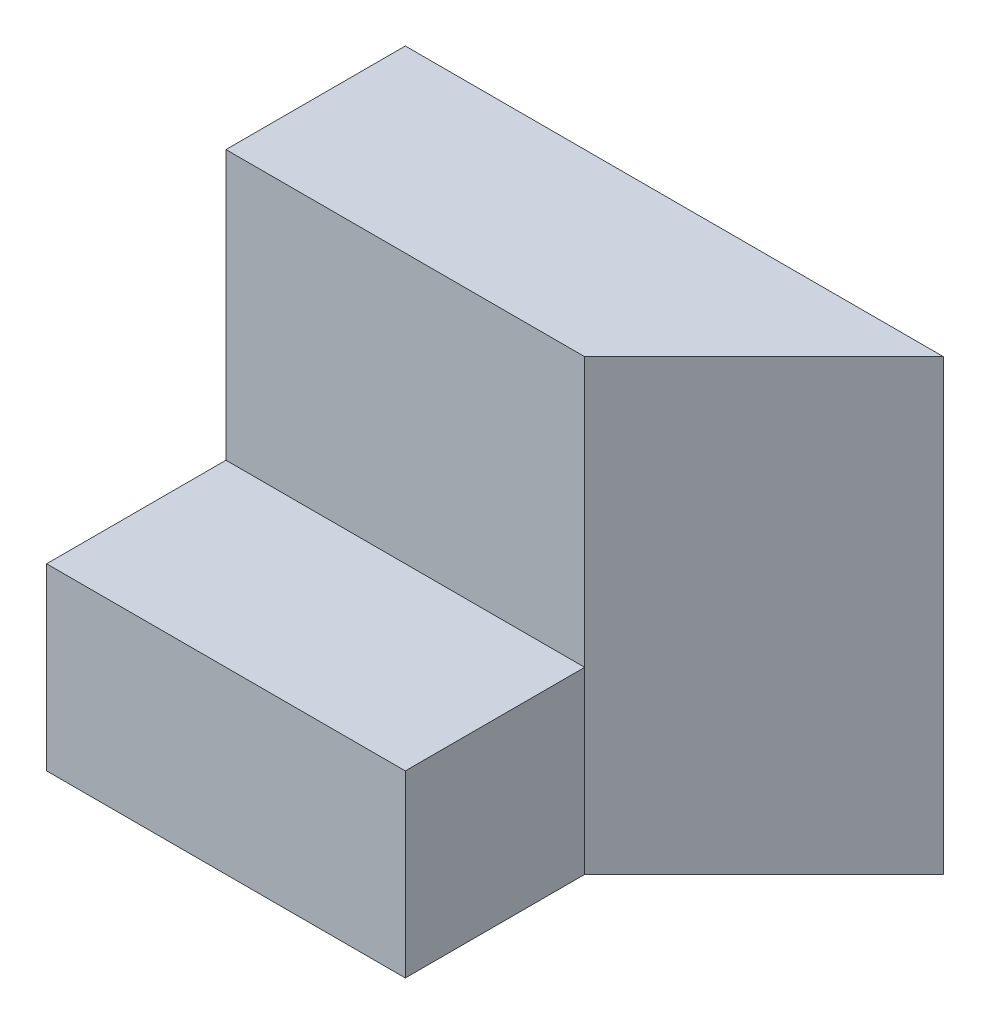
ISO-10303-21;
HEADER;
FILE_DESCRIPTION(('STEP AP214'),'2;1');
FILE_NAME('part.step','',(''),(''),'','','');
FILE_SCHEMA(('AUTOMOTIVE_DESIGN { 1 0 10303 214 1 1 1 1 }'));
ENDSEC;
DATA;
#1=APPLICATION_CONTEXT('core data for automotive mechanical design processes');
#2=APPLICATION_PROTOCOL_DEFINITION('international standard','automotive_design',2000,#1);
#3=PRODUCT_CONTEXT('',#1,'mechanical');
#4=PRODUCT('Part','Part','',(#3));
#5=PRODUCT_RELATED_PRODUCT_CATEGORY('part','',(#4));
#6=PRODUCT_DEFINITION_FORMATION('','',#4);
#7=PRODUCT_DEFINITION_CONTEXT('part definition',#1,'design');
#8=PRODUCT_DEFINITION('design','',#6,#7);
#9=PRODUCT_DEFINITION_SHAPE('','',#8);
#10=(LENGTH_UNIT() NAMED_UNIT(*) SI_UNIT(.MILLI.,.METRE.));
#11=(NAMED_UNIT(*) PLANE_ANGLE_UNIT() SI_UNIT($,.RADIAN.));
#12=(NAMED_UNIT(*) SI_UNIT($,.STERADIAN.) SOLID_ANGLE_UNIT());
#13=UNCERTAINTY_MEASURE_WITH_UNIT(LENGTH_MEASURE(1.E-05),#10,'distance_accuracy_value','');
#14=(GEOMETRIC_REPRESENTATION_CONTEXT(3) GLOBAL_UNCERTAINTY_ASSIGNED_CONTEXT((#13)) GLOBAL_UNIT_ASSIGNED_CONTEXT((#10,
#11,#12)) REPRESENTATION_CONTEXT('',''));
#15=CARTESIAN_POINT('',(0.,0.,0.));
#16=DIRECTION('',(0.,0.,1.));
#17=DIRECTION('',(1.,0.,0.));
#18=AXIS2_PLACEMENT_3D('',#15,#16,#17);
#19=CARTESIAN_POINT('',(0.,5.,0.));
#20=DIRECTION('',(0.,0.,-1.));
#21=DIRECTION('',(-1.,0.,0.));
#22=AXIS2_PLACEMENT_3D('',#19,#20,#21);
#23=PLANE('',#22);
#24=DIRECTION('',(0.,-1.,0.));
#25=VECTOR('',#24,1.);
#26=CARTESIAN_POINT('',(4.,5.,0.));
#27=LINE('',#26,#25);
#28=CARTESIAN_POINT('',(4.,2.,0.));
#29=VERTEX_POINT('',#28);
#30=CARTESIAN_POINT('',(4.,0.,0.));
#31=VERTEX_POINT('',#30);
#32=EDGE_CURVE('E134',#29,#31,#27,.T.);
#33=ORIENTED_EDGE('',*,*,#32,.F.);
#34=DIRECTION('',(-1.,0.,0.));
#35=VECTOR('',#34,1.);
#36=CARTESIAN_POINT('',(15.,2.,0.));
#37=LINE('',#36,#35);
#38=CARTESIAN_POINT('',(0.,2.,0.));
#39=VERTEX_POINT('',#38);
#40=EDGE_CURVE('E140',#29,#39,#37,.T.);
#41=ORIENTED_EDGE('',*,*,#40,.T.);
#42=DIRECTION('',(0.,-1.,0.));
#43=VECTOR('',#42,1.);
#44=CARTESIAN_POINT('',(0.,5.,0.));
#45=LINE('',#44,#43);
#46=CARTESIAN_POINT('',(0.,0.,0.));
#47=VERTEX_POINT('',#46);
#48=EDGE_CURVE('E41',#39,#47,#45,.T.);
#49=ORIENTED_EDGE('',*,*,#48,.T.);
#50=DIRECTION('',(1.,0.,0.));
#51=VECTOR('',#50,1.);
#52=CARTESIAN_POINT('',(0.,0.,0.));
#53=LINE('',#52,#51);
#54=EDGE_CURVE('E121',#47,#31,#53,.T.);
#55=ORIENTED_EDGE('',*,*,#54,.T.);
#56=EDGE_LOOP('',(#33,#41,#49,#55));
#57=FACE_BOUND('',#56,.T.);
#58=ADVANCED_FACE('F33',(#57),#23,.F.);
#59=CARTESIAN_POINT('',(4.,5.,-2.00000000000002));
#60=DIRECTION('',(-1.,0.,0.));
#61=DIRECTION('',(0.,0.,1.));
#62=AXIS2_PLACEMENT_3D('',#59,#60,#61);
#63=PLANE('',#62);
#64=DIRECTION('',(0.,-1.,0.));
#65=VECTOR('',#64,1.);
#66=CARTESIAN_POINT('',(4.,5.,-2.00000000000002));
#67=LINE('',#66,#65);
#68=CARTESIAN_POINT('',(3.99999999999998,2.,-2.));
#69=VERTEX_POINT('',#68);
#70=CARTESIAN_POINT('',(4.,0.,-2.00000000000002));
#71=VERTEX_POINT('',#70);
#72=EDGE_CURVE('E132',#69,#71,#67,.T.);
#73=ORIENTED_EDGE('',*,*,#72,.F.);
#74=DIRECTION('',(0.,0.,1.));
#75=VECTOR('',#74,1.);
#76=CARTESIAN_POINT('',(4.,2.,-2.00000000000002));
#77=LINE('',#76,#75);
#78=EDGE_CURVE('E116',#69,#29,#77,.T.);
#79=ORIENTED_EDGE('',*,*,#78,.T.);
#80=ORIENTED_EDGE('',*,*,#32,.T.);
#81=DIRECTION('',(0.,0.,-1.));
#82=VECTOR('',#81,1.);
#83=CARTESIAN_POINT('',(4.,0.,-2.00000000000002));
#84=LINE('',#83,#82);
#85=EDGE_CURVE('E124',#31,#71,#84,.T.);
#86=ORIENTED_EDGE('',*,*,#85,.T.);
#87=EDGE_LOOP('',(#73,#79,#80,#86));
#88=FACE_BOUND('',#87,.T.);
#89=ADVANCED_FACE('F146',(#88),#63,.F.);
#90=CARTESIAN_POINT('',(6.,5.,-4.));
#91=DIRECTION('',(-0.707106781186544,0.,-0.707106781186551));
#92=DIRECTION('',(-0.707106781186551,0.,0.707106781186544));
#93=AXIS2_PLACEMENT_3D('',#90,#91,#92);
#94=PLANE('',#93);
#95=DIRECTION('',(0.707106781186551,0.,-0.707106781186544));
#96=VECTOR('',#95,1.);
#97=CARTESIAN_POINT('',(6.,0.,-4.));
#98=LINE('',#97,#96);
#99=CARTESIAN_POINT('',(6.,0.,-4.));
#100=VERTEX_POINT('',#99);
#101=EDGE_CURVE('E70',#71,#100,#98,.T.);
#102=ORIENTED_EDGE('',*,*,#101,.T.);
#103=DIRECTION('',(0.,-1.,0.));
#104=VECTOR('',#103,1.);
#105=CARTESIAN_POINT('',(6.,5.,-4.));
#106=LINE('',#105,#104);
#107=CARTESIAN_POINT('',(6.,5.,-4.));
#108=VERTEX_POINT('',#107);
#109=EDGE_CURVE('E130',#108,#100,#106,.T.);
#110=ORIENTED_EDGE('',*,*,#109,.F.);
#111=DIRECTION('',(0.707106781186551,0.,-0.707106781186544));
#112=VECTOR('',#111,1.);
#113=CARTESIAN_POINT('',(6.,5.,-4.));
#114=LINE('',#113,#112);
#115=CARTESIAN_POINT('',(4.,5.,-2.00000000000002));
#116=VERTEX_POINT('',#115);
#117=EDGE_CURVE('E109',#116,#108,#114,.T.);
#118=ORIENTED_EDGE('',*,*,#117,.F.);
#119=EDGE_CURVE('E81',#116,#69,#67,.T.);
#120=ORIENTED_EDGE('',*,*,#119,.T.);
#121=ORIENTED_EDGE('',*,*,#72,.T.);
#122=EDGE_LOOP('',(#102,#110,#118,#120,#121));
#123=FACE_BOUND('',#122,.T.);
#124=ADVANCED_FACE('F165',(#123),#94,.F.);
#125=CARTESIAN_POINT('',(0.,5.,-4.));
#126=DIRECTION('',(0.,0.,1.));
#127=DIRECTION('',(1.,0.,0.));
#128=AXIS2_PLACEMENT_3D('',#125,#126,#127);
#129=PLANE('',#128);
#130=DIRECTION('',(-1.,0.,0.));
#131=VECTOR('',#130,1.);
#132=CARTESIAN_POINT('',(0.,0.,-4.));
#133=LINE('',#132,#131);
#134=CARTESIAN_POINT('',(0.,0.,-4.));
#135=VERTEX_POINT('',#134);
#136=EDGE_CURVE('E76',#100,#135,#133,.T.);
#137=ORIENTED_EDGE('',*,*,#136,.T.);
#138=DIRECTION('',(0.,-1.,0.));
#139=VECTOR('',#138,1.);
#140=CARTESIAN_POINT('',(0.,5.,-4.));
#141=LINE('',#140,#139);
#142=CARTESIAN_POINT('',(0.,5.,-4.));
#143=VERTEX_POINT('',#142);
#144=EDGE_CURVE('E120',#143,#135,#141,.T.);
#145=ORIENTED_EDGE('',*,*,#144,.F.);
#146=DIRECTION('',(-1.,0.,0.));
#147=VECTOR('',#146,1.);
#148=CARTESIAN_POINT('',(0.,5.,-4.));
#149=LINE('',#148,#147);
#150=EDGE_CURVE('E108',#108,#143,#149,.T.);
#151=ORIENTED_EDGE('',*,*,#150,.F.);
#152=ORIENTED_EDGE('',*,*,#109,.T.);
#153=EDGE_LOOP('',(#137,#145,#151,#152));
#154=FACE_BOUND('',#153,.T.);
#155=ADVANCED_FACE('F169',(#154),#129,.F.);
#156=CARTESIAN_POINT('',(0.,5.,-2.));
#157=DIRECTION('',(1.,0.,0.));
#158=DIRECTION('',(0.,0.,-1.));
#159=AXIS2_PLACEMENT_3D('',#156,#157,#158);
#160=PLANE('',#159);
#161=ORIENTED_EDGE('',*,*,#48,.F.);
#162=DIRECTION('',(0.,0.,1.));
#163=VECTOR('',#162,1.);
#164=CARTESIAN_POINT('',(0.,2.,0.));
#165=LINE('',#164,#163);
#166=CARTESIAN_POINT('',(0.,2.,-2.));
#167=VERTEX_POINT('',#166);
#168=EDGE_CURVE('E104',#167,#39,#165,.T.);
#169=ORIENTED_EDGE('',*,*,#168,.F.);
#170=DIRECTION('',(0.,-1.,0.));
#171=VECTOR('',#170,1.);
#172=CARTESIAN_POINT('',(0.,5.,-2.));
#173=LINE('',#172,#171);
#174=CARTESIAN_POINT('',(0.,5.,-2.));
#175=VERTEX_POINT('',#174);
#176=EDGE_CURVE('E98',#175,#167,#173,.T.);
#177=ORIENTED_EDGE('',*,*,#176,.F.);
#178=DIRECTION('',(0.,0.,1.));
#179=VECTOR('',#178,1.);
#180=CARTESIAN_POINT('',(0.,5.,-2.));
#181=LINE('',#180,#179);
#182=EDGE_CURVE('E49',#143,#175,#181,.T.);
#183=ORIENTED_EDGE('',*,*,#182,.F.);
#184=ORIENTED_EDGE('',*,*,#144,.T.);
#185=DIRECTION('',(0.,0.,1.));
#186=VECTOR('',#185,1.);
#187=CARTESIAN_POINT('',(0.,0.,-2.));
#188=LINE('',#187,#186);
#189=EDGE_CURVE('E110',#135,#47,#188,.T.);
#190=ORIENTED_EDGE('',*,*,#189,.T.);
#191=EDGE_LOOP('',(#161,#169,#177,#183,#184,#190));
#192=FACE_BOUND('',#191,.T.);
#193=ADVANCED_FACE('F103',(#192),#160,.F.);
#194=CARTESIAN_POINT('',(0.,5.,0.));
#195=DIRECTION('',(0.,1.,0.));
#196=DIRECTION('',(0.,0.,1.));
#197=AXIS2_PLACEMENT_3D('',#194,#195,#196);
#198=PLANE('',#197);
#199=DIRECTION('',(-1.,0.,0.));
#200=VECTOR('',#199,1.);
#201=CARTESIAN_POINT('',(0.,5.,-2.));
#202=LINE('',#201,#200);
#203=EDGE_CURVE('E11',#116,#175,#202,.T.);
#204=ORIENTED_EDGE('',*,*,#203,.F.);
#205=ORIENTED_EDGE('',*,*,#117,.T.);
#206=ORIENTED_EDGE('',*,*,#150,.T.);
#207=ORIENTED_EDGE('',*,*,#182,.T.);
#208=EDGE_LOOP('',(#204,#205,#206,#207));
#209=FACE_BOUND('',#208,.T.);
#210=ADVANCED_FACE('F106',(#209),#198,.T.);
#211=CARTESIAN_POINT('',(0.,0.,0.));
#212=DIRECTION('',(0.,1.,0.));
#213=DIRECTION('',(0.,0.,1.));
#214=AXIS2_PLACEMENT_3D('',#211,#212,#213);
#215=PLANE('',#214);
#216=ORIENTED_EDGE('',*,*,#54,.F.);
#217=ORIENTED_EDGE('',*,*,#189,.F.);
#218=ORIENTED_EDGE('',*,*,#136,.F.);
#219=ORIENTED_EDGE('',*,*,#101,.F.);
#220=ORIENTED_EDGE('',*,*,#85,.F.);
#221=EDGE_LOOP('',(#216,#217,#218,#219,#220));
#222=FACE_BOUND('',#221,.T.);
#223=ADVANCED_FACE('F143',(#222),#215,.F.);
#224=CARTESIAN_POINT('',(15.,2.,0.));
#225=DIRECTION('',(0.,-1.,0.));
#226=DIRECTION('',(0.,0.,-1.));
#227=AXIS2_PLACEMENT_3D('',#224,#225,#226);
#228=PLANE('',#227);
#229=DIRECTION('',(-1.,0.,0.));
#230=VECTOR('',#229,1.);
#231=CARTESIAN_POINT('',(15.,2.,-2.));
#232=LINE('',#231,#230);
#233=EDGE_CURVE('E149',#69,#167,#232,.T.);
#234=ORIENTED_EDGE('',*,*,#233,.T.);
#235=ORIENTED_EDGE('',*,*,#168,.T.);
#236=ORIENTED_EDGE('',*,*,#40,.F.);
#237=ORIENTED_EDGE('',*,*,#78,.F.);
#238=EDGE_LOOP('',(#234,#235,#236,#237));
#239=FACE_BOUND('',#238,.T.);
#240=ADVANCED_FACE('F152',(#239),#228,.F.);
#241=CARTESIAN_POINT('',(15.,5.,-2.));
#242=DIRECTION('',(0.,0.,-1.));
#243=DIRECTION('',(0.,1.,0.));
#244=AXIS2_PLACEMENT_3D('',#241,#242,#243);
#245=PLANE('',#244);
#246=ORIENTED_EDGE('',*,*,#203,.T.);
#247=ORIENTED_EDGE('',*,*,#176,.T.);
#248=ORIENTED_EDGE('',*,*,#233,.F.);
#249=ORIENTED_EDGE('',*,*,#119,.F.);
#250=EDGE_LOOP('',(#246,#247,#248,#249));
#251=FACE_BOUND('',#250,.T.);
#252=ADVANCED_FACE('F97',(#251),#245,.F.);
#253=CLOSED_SHELL('',(#58,#89,#124,#155,#193,#210,#223,#240,#252));
#254=MANIFOLD_SOLID_BREP('B2',#253);
#255=ADVANCED_BREP_SHAPE_REPRESENTATION('',(#18,#254),#14);
#256=SHAPE_DEFINITION_REPRESENTATION(#9,#255);
ENDSEC;
END-ISO-10303-21;
